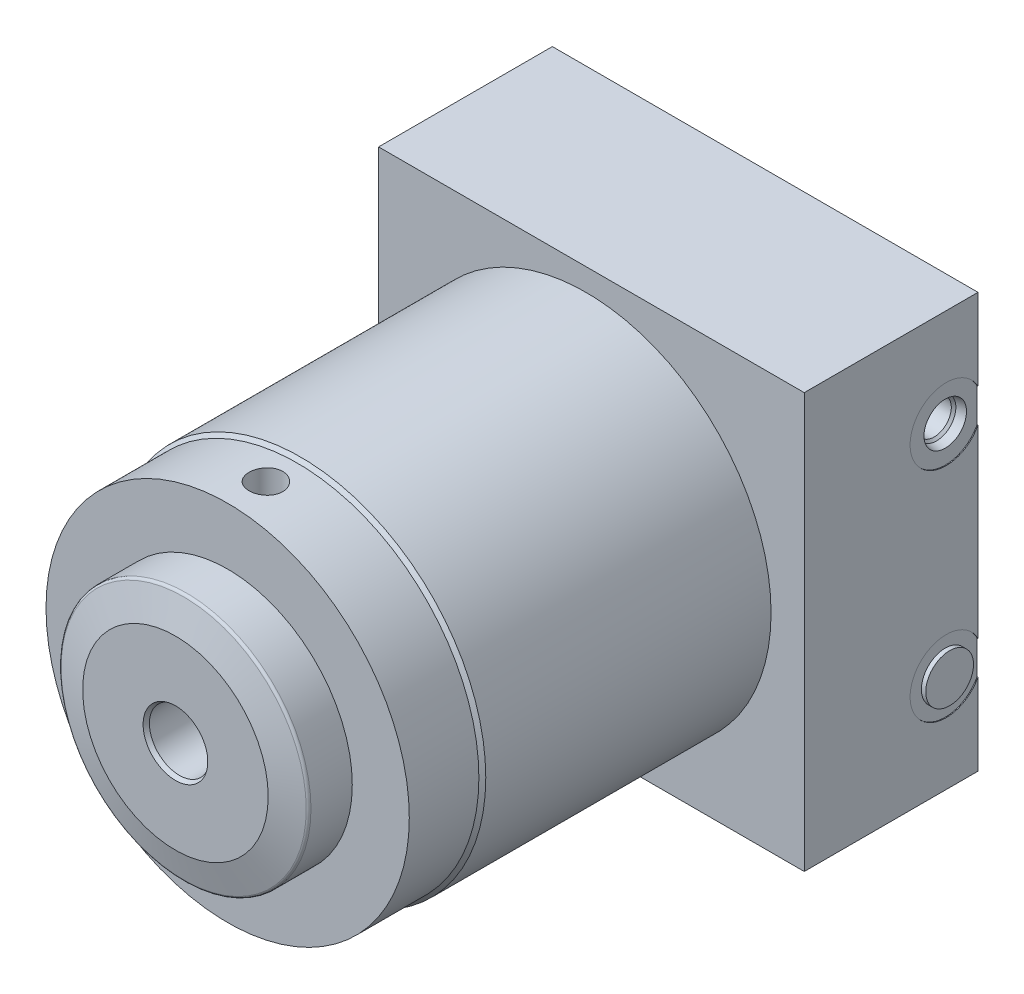
ISO-10303-21;
HEADER;
FILE_DESCRIPTION(('STEP AP214'),'2;1');
FILE_NAME('part.step','',(''),(''),'','','');
FILE_SCHEMA(('AUTOMOTIVE_DESIGN { 1 0 10303 214 1 1 1 1 }'));
ENDSEC;
DATA;
#1=APPLICATION_CONTEXT('core data for automotive mechanical design processes');
#2=APPLICATION_PROTOCOL_DEFINITION('international standard','automotive_design',2000,#1);
#3=PRODUCT_CONTEXT('',#1,'mechanical');
#4=PRODUCT('Part','Part','',(#3));
#5=PRODUCT_RELATED_PRODUCT_CATEGORY('part','',(#4));
#6=PRODUCT_DEFINITION_FORMATION('','',#4);
#7=PRODUCT_DEFINITION_CONTEXT('part definition',#1,'design');
#8=PRODUCT_DEFINITION('design','',#6,#7);
#9=PRODUCT_DEFINITION_SHAPE('','',#8);
#10=(LENGTH_UNIT() NAMED_UNIT(*) SI_UNIT(.MILLI.,.METRE.));
#11=(NAMED_UNIT(*) PLANE_ANGLE_UNIT() SI_UNIT($,.RADIAN.));
#12=(NAMED_UNIT(*) SI_UNIT($,.STERADIAN.) SOLID_ANGLE_UNIT());
#13=UNCERTAINTY_MEASURE_WITH_UNIT(LENGTH_MEASURE(1.E-05),#10,'distance_accuracy_value','');
#14=(GEOMETRIC_REPRESENTATION_CONTEXT(3) GLOBAL_UNCERTAINTY_ASSIGNED_CONTEXT((#13)) GLOBAL_UNIT_ASSIGNED_CONTEXT((#10,
#11,#12)) REPRESENTATION_CONTEXT('',''));
#15=CARTESIAN_POINT('',(0.,0.,0.));
#16=DIRECTION('',(0.,0.,1.));
#17=DIRECTION('',(1.,0.,0.));
#18=AXIS2_PLACEMENT_3D('',#15,#16,#17);
#19=CARTESIAN_POINT('',(63.246,-31.75,-17.7292));
#20=DIRECTION('',(1.,0.,0.));
#21=DIRECTION('',(0.,0.,-1.));
#22=AXIS2_PLACEMENT_3D('',#19,#20,#21);
#23=PLANE('',#22);
#24=DIRECTION('',(0.,1.,0.));
#25=VECTOR('',#24,1.);
#26=CARTESIAN_POINT('',(63.246,60.325,-27.0002));
#27=LINE('',#26,#25);
#28=CARTESIAN_POINT('',(63.246,-36.6312462804083,-27.0002));
#29=VERTEX_POINT('',#28);
#30=CARTESIAN_POINT('',(63.246,-26.8687537195917,-27.0002));
#31=VERTEX_POINT('',#30);
#32=EDGE_CURVE('E202',#29,#31,#27,.T.);
#33=ORIENTED_EDGE('',*,*,#32,.T.);
#34=CARTESIAN_POINT('',(63.246,-31.75,-17.7292));
#35=DIRECTION('',(1.,0.,0.));
#36=DIRECTION('',(0.,0.,-1.));
#37=AXIS2_PLACEMENT_3D('',#34,#35,#36);
#38=CIRCLE('',#37,10.4775);
#39=EDGE_CURVE('E57',#31,#29,#38,.T.);
#40=ORIENTED_EDGE('',*,*,#39,.T.);
#41=EDGE_LOOP('',(#33,#40));
#42=FACE_BOUND('',#41,.T.);
#43=CARTESIAN_POINT('',(63.246,-31.75,-17.7292));
#44=DIRECTION('',(1.,0.,0.));
#45=DIRECTION('',(0.,0.,-1.));
#46=AXIS2_PLACEMENT_3D('',#43,#44,#45);
#47=CIRCLE('',#46,6.9469);
#48=CARTESIAN_POINT('',(63.246,-31.75,-24.6761));
#49=VERTEX_POINT('',#48);
#50=EDGE_CURVE('E117',#49,#49,#47,.T.);
#51=ORIENTED_EDGE('',*,*,#50,.F.);
#52=EDGE_LOOP('',(#51));
#53=FACE_BOUND('',#52,.T.);
#54=ADVANCED_FACE('F32',(#42,#53),#23,.T.);
#55=CARTESIAN_POINT('',(0.,0.,127.7874));
#56=DIRECTION('',(0.,0.,-1.));
#57=DIRECTION('',(-1.,0.,0.));
#58=AXIS2_PLACEMENT_3D('',#55,#56,#57);
#59=CYLINDRICAL_SURFACE('',#58,53.848);
#60=CARTESIAN_POINT('',(0.,0.,106.5403));
#61=DIRECTION('',(0.,0.,1.));
#62=DIRECTION('',(1.,0.,0.));
#63=AXIS2_PLACEMENT_3D('',#60,#61,#62);
#64=CIRCLE('',#63,53.848);
#65=CARTESIAN_POINT('',(53.848,0.,106.5403));
#66=VERTEX_POINT('',#65);
#67=EDGE_CURVE('E190',#66,#66,#64,.T.);
#68=ORIENTED_EDGE('',*,*,#67,.F.);
#69=EDGE_LOOP('',(#68));
#70=FACE_BOUND('',#69,.T.);
#71=CARTESIAN_POINT('',(0.,0.,23.5458));
#72=DIRECTION('',(0.,0.,-1.));
#73=DIRECTION('',(-1.,0.,0.));
#74=AXIS2_PLACEMENT_3D('',#71,#72,#73);
#75=CIRCLE('',#74,53.848);
#76=CARTESIAN_POINT('',(-53.848,0.,23.5458));
#77=VERTEX_POINT('',#76);
#78=EDGE_CURVE('E199',#77,#77,#75,.T.);
#79=ORIENTED_EDGE('',*,*,#78,.F.);
#80=EDGE_LOOP('',(#79));
#81=FACE_BOUND('',#80,.T.);
#82=ADVANCED_FACE('F273',(#70,#81),#59,.T.);
#83=CARTESIAN_POINT('',(0.,0.,127.7874));
#84=DIRECTION('',(0.,0.,1.));
#85=DIRECTION('',(1.,0.,0.));
#86=AXIS2_PLACEMENT_3D('',#83,#84,#85);
#87=PLANE('',#86);
#88=CARTESIAN_POINT('',(0.,0.,127.7874));
#89=DIRECTION('',(0.,0.,1.));
#90=DIRECTION('',(1.,0.,0.));
#91=AXIS2_PLACEMENT_3D('',#88,#89,#90);
#92=CIRCLE('',#91,52.8447);
#93=CARTESIAN_POINT('',(52.8447,0.,127.7874));
#94=VERTEX_POINT('',#93);
#95=EDGE_CURVE('E196',#94,#94,#92,.T.);
#96=ORIENTED_EDGE('',*,*,#95,.T.);
#97=EDGE_LOOP('',(#96));
#98=FACE_BOUND('',#97,.T.);
#99=CARTESIAN_POINT('',(0.,0.,127.7874));
#100=DIRECTION('',(0.,0.,1.));
#101=DIRECTION('',(1.,0.,0.));
#102=AXIS2_PLACEMENT_3D('',#99,#100,#101);
#103=CIRCLE('',#102,36.2585);
#104=CARTESIAN_POINT('',(36.2585,0.,127.7874));
#105=VERTEX_POINT('',#104);
#106=EDGE_CURVE('E187',#105,#105,#103,.T.);
#107=ORIENTED_EDGE('',*,*,#106,.F.);
#108=EDGE_LOOP('',(#107));
#109=FACE_BOUND('',#108,.T.);
#110=ADVANCED_FACE('F330',(#98,#109),#87,.T.);
#111=CARTESIAN_POINT('',(0.,0.,160.082178916781));
#112=DIRECTION('',(0.,0.,1.));
#113=DIRECTION('',(1.,0.,0.));
#114=AXIS2_PLACEMENT_3D('',#111,#112,#113);
#115=CYLINDRICAL_SURFACE('',#114,52.8447);
#116=CARTESIAN_POINT('',(0.,-52.8447,121.5517));
#117=CARTESIAN_POINT('',(-0.13705700282078,-52.8447003261192,121.551701292624));
#118=CARTESIAN_POINT('',(-0.27409407378406,-52.8441657135478,121.545935053901));
#119=CARTESIAN_POINT('',(-0.547235526896936,-52.8420428949678,121.522912528455));
#120=CARTESIAN_POINT('',(-0.683339674091867,-52.8404544327365,121.50565344747));
#121=CARTESIAN_POINT('',(-0.953708841805919,-52.8362664879881,121.459748221065));
#122=CARTESIAN_POINT('',(-1.08797227975399,-52.8336661858339,121.431092843703));
#123=CARTESIAN_POINT('',(-1.35364451982924,-52.8275271623704,121.362591627997));
#124=CARTESIAN_POINT('',(-1.48505225848269,-52.8239880977287,121.322741695169));
#125=CARTESIAN_POINT('',(-1.74390520915612,-52.8160758271064,121.232187796075));
#126=CARTESIAN_POINT('',(-1.87135409430821,-52.8117034229448,121.181494257574));
#127=CARTESIAN_POINT('',(-2.12156866939713,-52.8022437628651,121.069574147021));
#128=CARTESIAN_POINT('',(-2.2443326146653,-52.7971562438788,121.008343696904));
#129=CARTESIAN_POINT('',(-2.48419501673236,-52.7864139685561,120.875838277263));
#130=CARTESIAN_POINT('',(-2.60129671199148,-52.7807595422828,120.804569142756));
#131=CARTESIAN_POINT('',(-2.82913313363359,-52.7690377292235,120.652436386492));
#132=CARTESIAN_POINT('',(-2.93986548643539,-52.762970190304,120.571569221913));
#133=CARTESIAN_POINT('',(-3.15439830030838,-52.7505797515681,120.40062719304));
#134=CARTESIAN_POINT('',(-3.25818156261035,-52.7442562761268,120.310530785407));
#135=CARTESIAN_POINT('',(-3.45783341988848,-52.7315438636178,120.121891707345));
#136=CARTESIAN_POINT('',(-3.55369907556744,-52.7251549032202,120.023345927633));
#137=CARTESIAN_POINT('',(-3.73676849480103,-52.7124966025206,119.818563075617));
#138=CARTESIAN_POINT('',(-3.82397504753015,-52.7062272242292,119.71232849913));
#139=CARTESIAN_POINT('',(-3.98917633214333,-52.6939812095426,119.492845813926));
#140=CARTESIAN_POINT('',(-4.06716765269796,-52.6880046820323,119.379595131461));
#141=CARTESIAN_POINT('',(-4.2134530712586,-52.676508285125,119.146743109424));
#142=CARTESIAN_POINT('',(-4.28173300495795,-52.6709890875514,119.027132836316));
#143=CARTESIAN_POINT('',(-4.40799573299597,-52.6605725966058,118.782515815191));
#144=CARTESIAN_POINT('',(-4.46597470565961,-52.6556755342382,118.657507085629));
#145=CARTESIAN_POINT('',(-4.57116592163192,-52.6466480950573,118.403058099893));
#146=CARTESIAN_POINT('',(-4.61838231764562,-52.6425174226498,118.273619575189));
#147=CARTESIAN_POINT('',(-4.70174797643925,-52.6351366338674,118.011187884259));
#148=CARTESIAN_POINT('',(-4.73789316182492,-52.6318868419609,117.878193427985));
#149=CARTESIAN_POINT('',(-4.82906268411877,-52.6236297247141,117.476162956106));
#150=CARTESIAN_POINT('',(-4.86724159143658,-52.6200773175563,117.203059348283));
#151=CARTESIAN_POINT('',(-4.89721629716278,-52.6172954862447,116.654447711109));
#152=CARTESIAN_POINT('',(-4.88901315032654,-52.6180659637859,116.378939736578));
#153=CARTESIAN_POINT('',(-4.82662513005306,-52.6238251502279,115.834058082182));
#154=CARTESIAN_POINT('',(-4.77258279640305,-52.6288007827662,115.564668041559));
#155=CARTESIAN_POINT('',(-4.62025593503476,-52.6423911599283,115.038809033096));
#156=CARTESIAN_POINT('',(-4.52197088733053,-52.651005947323,114.782340217158));
#157=CARTESIAN_POINT('',(-4.2837944277814,-52.6709185004957,114.289138624571));
#158=CARTESIAN_POINT('',(-4.14383942500829,-52.6822203615649,114.052436725546));
#159=CARTESIAN_POINT('',(-3.82634046865282,-52.7062301673473,113.605829366491));
#160=CARTESIAN_POINT('',(-3.64879557428614,-52.7189381472485,113.395924577338));
#161=CARTESIAN_POINT('',(-3.26035907581587,-52.7443865407074,113.008040171498));
#162=CARTESIAN_POINT('',(-3.04934427708855,-52.7571268959207,112.830183897068));
#163=CARTESIAN_POINT('',(-2.60038654801204,-52.7811591144091,112.512400356881));
#164=CARTESIAN_POINT('',(-2.36244359366438,-52.7924509763931,112.372473124927));
#165=CARTESIAN_POINT('',(-1.86630093131392,-52.8123168709128,112.134525855316));
#166=CARTESIAN_POINT('',(-1.60809838533135,-52.8208905218285,112.036511701323));
#167=CARTESIAN_POINT('',(-1.07880460132766,-52.8343498816292,111.885261360395));
#168=CARTESIAN_POINT('',(-0.807713693341591,-52.8392356848958,111.832024027503));
#169=CARTESIAN_POINT('',(-0.261407067711391,-52.8447567372573,111.771994147906));
#170=CARTESIAN_POINT('',(0.0137897880380407,-52.8454075700579,111.765031319771));
#171=CARTESIAN_POINT('',(0.561435085721646,-52.842427059595,111.797301412246));
#172=CARTESIAN_POINT('',(0.833883559325274,-52.8387957657311,111.836533799937));
#173=CARTESIAN_POINT('',(1.36780960386314,-52.8276692060877,111.959939435147));
#174=CARTESIAN_POINT('',(1.62930566964462,-52.8201807637625,112.044033330163));
#175=CARTESIAN_POINT('',(2.13447793422536,-52.802180530434,112.254693621062));
#176=CARTESIAN_POINT('',(2.3781537883167,-52.7916686809665,112.38126083827));
#177=CARTESIAN_POINT('',(2.84154086022017,-52.7687597997701,112.673699676334));
#178=CARTESIAN_POINT('',(3.06118092791831,-52.7563574179359,112.839683612572));
#179=CARTESIAN_POINT('',(3.46954227601198,-52.731077506044,113.206083587671));
#180=CARTESIAN_POINT('',(3.65826289325939,-52.7181999658026,113.406500364844));
#181=CARTESIAN_POINT('',(4.00001651273476,-52.6933744921516,113.836814348216));
#182=CARTESIAN_POINT('',(4.15293805800524,-52.6814295372159,114.066800260359));
#183=CARTESIAN_POINT('',(4.41798597452665,-52.6598659440582,114.549298323095));
#184=CARTESIAN_POINT('',(4.53011283352248,-52.6502472780234,114.801810204321));
#185=CARTESIAN_POINT('',(4.71020561717052,-52.6344419563786,115.321753035862));
#186=CARTESIAN_POINT('',(4.77823875147994,-52.6282500796157,115.589160602591));
#187=CARTESIAN_POINT('',(4.86841178718951,-52.6199869881758,116.131813567986));
#188=CARTESIAN_POINT('',(4.89055279915964,-52.6179156737831,116.407058776821));
#189=CARTESIAN_POINT('',(4.8889153933128,-52.6180644490635,116.818987437209));
#190=CARTESIAN_POINT('',(4.88259347520532,-52.6186536740755,116.955955572445));
#191=CARTESIAN_POINT('',(4.85848103212153,-52.6208861376417,117.228856228747));
#192=CARTESIAN_POINT('',(4.84069476066245,-52.6225289852785,117.364789114993));
#193=CARTESIAN_POINT('',(4.79376925771384,-52.6268243407372,117.63470613269));
#194=CARTESIAN_POINT('',(4.76462585765121,-52.6294772192772,117.768689529837));
#195=CARTESIAN_POINT('',(4.69521325351769,-52.6357151111062,118.033670315625));
#196=CARTESIAN_POINT('',(4.65494812367394,-52.6392997830228,118.164668778751));
#197=CARTESIAN_POINT('',(4.56356524546467,-52.6473009011187,118.422835918452));
#198=CARTESIAN_POINT('',(4.51244462955513,-52.6517175670395,118.55000357294));
#199=CARTESIAN_POINT('',(4.39974458801886,-52.6612548329167,118.79953299031));
#200=CARTESIAN_POINT('',(4.33816899015739,-52.6663751751137,118.921896491968));
#201=CARTESIAN_POINT('',(4.20496073716075,-52.677178054019,119.161051129375));
#202=CARTESIAN_POINT('',(4.133324561191,-52.6828607873371,119.277840295056));
#203=CARTESIAN_POINT('',(3.98054622279723,-52.6946243471303,119.504942423582));
#204=CARTESIAN_POINT('',(3.89940752497808,-52.7007050281597,119.615257724903));
#205=CARTESIAN_POINT('',(3.72783129316156,-52.713119968691,119.829115257724));
#206=CARTESIAN_POINT('',(3.63735794080093,-52.7194551433495,119.932628701594));
#207=CARTESIAN_POINT('',(3.44805563837857,-52.7321744636716,120.131634458323));
#208=CARTESIAN_POINT('',(3.34922975446691,-52.7385585905896,120.227129689165));
#209=CARTESIAN_POINT('',(3.14382563304375,-52.7512015954118,120.409525280512));
#210=CARTESIAN_POINT('',(3.03724270688454,-52.7574603946,120.496420366626));
#211=CARTESIAN_POINT('',(2.81716805971761,-52.7696695149176,120.660904730576));
#212=CARTESIAN_POINT('',(2.70367890381534,-52.7756199490775,120.738497432075));
#213=CARTESIAN_POINT('',(2.47025271206718,-52.7870614495552,120.884051322779));
#214=CARTESIAN_POINT('',(2.35029978922995,-52.7925512905193,120.951987134403));
#215=CARTESIAN_POINT('',(2.1051113938884,-52.8028964501513,121.077477609259));
#216=CARTESIAN_POINT('',(1.97987787568283,-52.8077520008844,121.135036072159));
#217=CARTESIAN_POINT('',(1.72507935497155,-52.816689130906,121.239343648041));
#218=CARTESIAN_POINT('',(1.59551804549026,-52.8207713512062,121.286101720552));
#219=CARTESIAN_POINT('',(1.3329337033625,-52.8280499517845,121.368518606586));
#220=CARTESIAN_POINT('',(1.19991153845807,-52.8312465518172,121.404180173826));
#221=CARTESIAN_POINT('',(0.890904404889697,-52.8374781097648,121.473179222729));
#222=CARTESIAN_POINT('',(0.714023172887017,-52.8401757208131,121.502596703747));
#223=CARTESIAN_POINT('',(0.358083286573468,-52.8437864499009,121.541856214812));
#224=CARTESIAN_POINT('',(0.179024639684624,-52.8446995740212,121.551698311567));
#225=CARTESIAN_POINT('',(0.,-52.8447,121.5517));
#226=B_SPLINE_CURVE_WITH_KNOTS('',3,(#116,#117,#118,#119,#120,#121,#122,#123,#124,#125,#126,
#127,#128,#129,#130,#131,#132,#133,#134,#135,#136,#137,#138,#139,#140,#141,#142,#143,#144,#145,
#146,#147,#148,#149,#150,#151,#152,#153,#154,#155,#156,#157,#158,#159,#160,#161,#162,#163,#164,
#165,#166,#167,#168,#169,#170,#171,#172,#173,#174,#175,#176,#177,#178,#179,#180,#181,#182,#183,
#184,#185,#186,#187,#188,#189,#190,#191,#192,#193,#194,#195,#196,#197,#198,#199,#200,#201,#202,
#203,#204,#205,#206,#207,#208,#209,#210,#211,#212,#213,#214,#215,#216,#217,#218,#219,#220,#221,
#222,#223,#224,#225),.UNSPECIFIED.,.T.,.F.,(4,2,2,2,2,2,2,2,2,2,2,2,2,2,2,2,2,2,2,2,2,2,2,2,2,2,
2,2,2,2,2,2,2,2,2,2,2,2,2,2,2,2,2,2,2,2,2,2,2,2,2,2,2,2,4),(0.,0.411014481642333,
0.822128930033263,1.23357709574276,1.6451759478492,2.05638075081158,2.46773722086711,
2.87885556781401,3.29012614139795,3.7023795983892,4.11478541698117,4.52705796208171,
4.93948264879175,5.35250283081183,5.76567592553228,6.1786893278819,6.5918546557342,
7.41491417840075,8.23795498428198,9.05844583689334,9.87894633301023,10.7007054380665,
11.5224851122026,12.347362920251,13.1722414634392,13.9972357632719,14.8222089486652,
15.6441446997098,16.4660709687909,17.2865481850007,18.1070412680379,18.9299009551815,
19.7527782883837,20.5781844747211,21.4035807921044,22.2277160255715,23.0518313150808,
23.4627771930409,23.8735706890966,24.2845151069306,24.6953091825554,25.1062119072736,
25.5169645159038,25.9278612328096,26.3386086010808,26.7509952189796,27.1632311050277,
27.5757182651083,27.9880531437718,28.4014523310768,28.8146998434714,29.2276033027462,
29.6404042136933,30.17727550601,30.7141449688378),.UNSPECIFIED.);
#227=CARTESIAN_POINT('',(0.,-52.8447,121.5517));
#228=VERTEX_POINT('',#227);
#229=EDGE_CURVE('E11',#228,#228,#226,.T.);
#230=ORIENTED_EDGE('',*,*,#229,.F.);
#231=EDGE_LOOP('',(#230));
#232=FACE_BOUND('',#231,.T.);
#233=CARTESIAN_POINT('',(0.,52.8447,121.5517));
#234=CARTESIAN_POINT('',(0.13705700282078,52.8447003261192,121.551701292624));
#235=CARTESIAN_POINT('',(0.27409407378406,52.8441657135478,121.545935053901));
#236=CARTESIAN_POINT('',(0.547235526896936,52.8420428949678,121.522912528455));
#237=CARTESIAN_POINT('',(0.683339674091867,52.8404544327365,121.50565344747));
#238=CARTESIAN_POINT('',(0.953708841805919,52.8362664879881,121.459748221065));
#239=CARTESIAN_POINT('',(1.08797227975399,52.8336661858339,121.431092843703));
#240=CARTESIAN_POINT('',(1.35364451982924,52.8275271623704,121.362591627997));
#241=CARTESIAN_POINT('',(1.48505225848269,52.8239880977287,121.322741695169));
#242=CARTESIAN_POINT('',(1.74390520915612,52.8160758271064,121.232187796075));
#243=CARTESIAN_POINT('',(1.87135409430821,52.8117034229448,121.181494257574));
#244=CARTESIAN_POINT('',(2.12156866939713,52.8022437628651,121.069574147021));
#245=CARTESIAN_POINT('',(2.2443326146653,52.7971562438788,121.008343696904));
#246=CARTESIAN_POINT('',(2.48419501673236,52.7864139685561,120.875838277263));
#247=CARTESIAN_POINT('',(2.60129671199148,52.7807595422828,120.804569142756));
#248=CARTESIAN_POINT('',(2.82913313363359,52.7690377292235,120.652436386492));
#249=CARTESIAN_POINT('',(2.93986548643539,52.762970190304,120.571569221913));
#250=CARTESIAN_POINT('',(3.15439830030838,52.7505797515681,120.40062719304));
#251=CARTESIAN_POINT('',(3.25818156261035,52.7442562761268,120.310530785407));
#252=CARTESIAN_POINT('',(3.45783341988848,52.7315438636178,120.121891707345));
#253=CARTESIAN_POINT('',(3.55369907556744,52.7251549032202,120.023345927633));
#254=CARTESIAN_POINT('',(3.73676849480103,52.7124966025206,119.818563075617));
#255=CARTESIAN_POINT('',(3.82397504753015,52.7062272242292,119.71232849913));
#256=CARTESIAN_POINT('',(3.98917633214333,52.6939812095426,119.492845813926));
#257=CARTESIAN_POINT('',(4.06716765269796,52.6880046820323,119.379595131461));
#258=CARTESIAN_POINT('',(4.2134530712586,52.676508285125,119.146743109424));
#259=CARTESIAN_POINT('',(4.28173300495795,52.6709890875514,119.027132836316));
#260=CARTESIAN_POINT('',(4.40799573299597,52.6605725966058,118.782515815191));
#261=CARTESIAN_POINT('',(4.46597470565961,52.6556755342382,118.657507085629));
#262=CARTESIAN_POINT('',(4.57116592163192,52.6466480950573,118.403058099893));
#263=CARTESIAN_POINT('',(4.61838231764562,52.6425174226498,118.273619575189));
#264=CARTESIAN_POINT('',(4.70174797643925,52.6351366338674,118.011187884259));
#265=CARTESIAN_POINT('',(4.73789316182492,52.6318868419609,117.878193427985));
#266=CARTESIAN_POINT('',(4.82906268411877,52.6236297247141,117.476162956106));
#267=CARTESIAN_POINT('',(4.86724159143658,52.6200773175563,117.203059348283));
#268=CARTESIAN_POINT('',(4.89721629716278,52.6172954862447,116.654447711109));
#269=CARTESIAN_POINT('',(4.88901315032654,52.6180659637859,116.378939736578));
#270=CARTESIAN_POINT('',(4.82662513005306,52.6238251502279,115.834058082182));
#271=CARTESIAN_POINT('',(4.77258279640305,52.6288007827662,115.564668041559));
#272=CARTESIAN_POINT('',(4.62025593503476,52.6423911599283,115.038809033096));
#273=CARTESIAN_POINT('',(4.52197088733053,52.651005947323,114.782340217158));
#274=CARTESIAN_POINT('',(4.2837944277814,52.6709185004957,114.289138624571));
#275=CARTESIAN_POINT('',(4.14383942500829,52.6822203615649,114.052436725546));
#276=CARTESIAN_POINT('',(3.82634046865282,52.7062301673473,113.605829366491));
#277=CARTESIAN_POINT('',(3.64879557428614,52.7189381472485,113.395924577338));
#278=CARTESIAN_POINT('',(3.26035907581587,52.7443865407074,113.008040171498));
#279=CARTESIAN_POINT('',(3.04934427708855,52.7571268959207,112.830183897068));
#280=CARTESIAN_POINT('',(2.60038654801204,52.7811591144091,112.512400356881));
#281=CARTESIAN_POINT('',(2.36244359366438,52.7924509763931,112.372473124927));
#282=CARTESIAN_POINT('',(1.86630093131392,52.8123168709128,112.134525855316));
#283=CARTESIAN_POINT('',(1.60809838533135,52.8208905218285,112.036511701323));
#284=CARTESIAN_POINT('',(1.07880460132766,52.8343498816292,111.885261360395));
#285=CARTESIAN_POINT('',(0.807713693341591,52.8392356848958,111.832024027503));
#286=CARTESIAN_POINT('',(0.261407067711391,52.8447567372573,111.771994147906));
#287=CARTESIAN_POINT('',(-0.0137897880380407,52.8454075700579,111.765031319771));
#288=CARTESIAN_POINT('',(-0.561435085721646,52.842427059595,111.797301412246));
#289=CARTESIAN_POINT('',(-0.833883559325274,52.8387957657311,111.836533799937));
#290=CARTESIAN_POINT('',(-1.36780960386314,52.8276692060877,111.959939435147));
#291=CARTESIAN_POINT('',(-1.62930566964462,52.8201807637625,112.044033330163));
#292=CARTESIAN_POINT('',(-2.13447793422536,52.802180530434,112.254693621062));
#293=CARTESIAN_POINT('',(-2.3781537883167,52.7916686809665,112.38126083827));
#294=CARTESIAN_POINT('',(-2.84154086022017,52.7687597997701,112.673699676334));
#295=CARTESIAN_POINT('',(-3.06118092791831,52.7563574179359,112.839683612572));
#296=CARTESIAN_POINT('',(-3.46954227601198,52.731077506044,113.206083587671));
#297=CARTESIAN_POINT('',(-3.65826289325939,52.7181999658026,113.406500364844));
#298=CARTESIAN_POINT('',(-4.00001651273476,52.6933744921516,113.836814348216));
#299=CARTESIAN_POINT('',(-4.15293805800524,52.6814295372159,114.066800260359));
#300=CARTESIAN_POINT('',(-4.41798597452665,52.6598659440582,114.549298323095));
#301=CARTESIAN_POINT('',(-4.53011283352248,52.6502472780234,114.801810204321));
#302=CARTESIAN_POINT('',(-4.71020561717052,52.6344419563786,115.321753035862));
#303=CARTESIAN_POINT('',(-4.77823875147994,52.6282500796157,115.589160602591));
#304=CARTESIAN_POINT('',(-4.86841178718951,52.6199869881758,116.131813567986));
#305=CARTESIAN_POINT('',(-4.89055279915964,52.6179156737831,116.407058776821));
#306=CARTESIAN_POINT('',(-4.8889153933128,52.6180644490635,116.818987437209));
#307=CARTESIAN_POINT('',(-4.88259347520532,52.6186536740755,116.955955572445));
#308=CARTESIAN_POINT('',(-4.85848103212153,52.6208861376417,117.228856228747));
#309=CARTESIAN_POINT('',(-4.84069476066245,52.6225289852785,117.364789114993));
#310=CARTESIAN_POINT('',(-4.79376925771384,52.6268243407372,117.63470613269));
#311=CARTESIAN_POINT('',(-4.76462585765121,52.6294772192772,117.768689529837));
#312=CARTESIAN_POINT('',(-4.69521325351769,52.6357151111062,118.033670315625));
#313=CARTESIAN_POINT('',(-4.65494812367394,52.6392997830228,118.164668778751));
#314=CARTESIAN_POINT('',(-4.56356524546467,52.6473009011187,118.422835918452));
#315=CARTESIAN_POINT('',(-4.51244462955513,52.6517175670395,118.55000357294));
#316=CARTESIAN_POINT('',(-4.39974458801886,52.6612548329167,118.79953299031));
#317=CARTESIAN_POINT('',(-4.33816899015739,52.6663751751137,118.921896491968));
#318=CARTESIAN_POINT('',(-4.20496073716075,52.677178054019,119.161051129375));
#319=CARTESIAN_POINT('',(-4.133324561191,52.6828607873371,119.277840295056));
#320=CARTESIAN_POINT('',(-3.98054622279723,52.6946243471303,119.504942423582));
#321=CARTESIAN_POINT('',(-3.89940752497808,52.7007050281597,119.615257724903));
#322=CARTESIAN_POINT('',(-3.72783129316156,52.713119968691,119.829115257724));
#323=CARTESIAN_POINT('',(-3.63735794080093,52.7194551433495,119.932628701594));
#324=CARTESIAN_POINT('',(-3.44805563837857,52.7321744636716,120.131634458323));
#325=CARTESIAN_POINT('',(-3.34922975446691,52.7385585905896,120.227129689165));
#326=CARTESIAN_POINT('',(-3.14382563304375,52.7512015954118,120.409525280512));
#327=CARTESIAN_POINT('',(-3.03724270688454,52.7574603946,120.496420366626));
#328=CARTESIAN_POINT('',(-2.81716805971761,52.7696695149176,120.660904730576));
#329=CARTESIAN_POINT('',(-2.70367890381534,52.7756199490775,120.738497432075));
#330=CARTESIAN_POINT('',(-2.47025271206718,52.7870614495552,120.884051322779));
#331=CARTESIAN_POINT('',(-2.35029978922995,52.7925512905193,120.951987134403));
#332=CARTESIAN_POINT('',(-2.1051113938884,52.8028964501513,121.077477609259));
#333=CARTESIAN_POINT('',(-1.97987787568283,52.8077520008844,121.135036072159));
#334=CARTESIAN_POINT('',(-1.72507935497155,52.816689130906,121.239343648041));
#335=CARTESIAN_POINT('',(-1.59551804549026,52.8207713512062,121.286101720552));
#336=CARTESIAN_POINT('',(-1.3329337033625,52.8280499517845,121.368518606586));
#337=CARTESIAN_POINT('',(-1.19991153845807,52.8312465518172,121.404180173826));
#338=CARTESIAN_POINT('',(-0.890904404889697,52.8374781097648,121.473179222729));
#339=CARTESIAN_POINT('',(-0.714023172887017,52.8401757208131,121.502596703747));
#340=CARTESIAN_POINT('',(-0.358083286573468,52.8437864499009,121.541856214812));
#341=CARTESIAN_POINT('',(-0.179024639684624,52.8446995740212,121.551698311567));
#342=CARTESIAN_POINT('',(0.,52.8447,121.5517));
#343=B_SPLINE_CURVE_WITH_KNOTS('',3,(#233,#234,#235,#236,#237,#238,#239,#240,#241,#242,#243,
#244,#245,#246,#247,#248,#249,#250,#251,#252,#253,#254,#255,#256,#257,#258,#259,#260,#261,#262,
#263,#264,#265,#266,#267,#268,#269,#270,#271,#272,#273,#274,#275,#276,#277,#278,#279,#280,#281,
#282,#283,#284,#285,#286,#287,#288,#289,#290,#291,#292,#293,#294,#295,#296,#297,#298,#299,#300,
#301,#302,#303,#304,#305,#306,#307,#308,#309,#310,#311,#312,#313,#314,#315,#316,#317,#318,#319,
#320,#321,#322,#323,#324,#325,#326,#327,#328,#329,#330,#331,#332,#333,#334,#335,#336,#337,#338,
#339,#340,#341,#342),.UNSPECIFIED.,.T.,.F.,(4,2,2,2,2,2,2,2,2,2,2,2,2,2,2,2,2,2,2,2,2,2,2,2,2,2,
2,2,2,2,2,2,2,2,2,2,2,2,2,2,2,2,2,2,2,2,2,2,2,2,2,2,2,2,4),(0.,0.411014481642333,
0.822128930033263,1.23357709574276,1.6451759478492,2.05638075081158,2.46773722086711,
2.87885556781401,3.29012614139795,3.7023795983892,4.11478541698117,4.52705796208171,
4.93948264879175,5.35250283081183,5.76567592553228,6.1786893278819,6.5918546557342,
7.41491417840075,8.23795498428198,9.05844583689334,9.87894633301023,10.7007054380665,
11.5224851122026,12.347362920251,13.1722414634392,13.9972357632719,14.8222089486652,
15.6441446997098,16.4660709687909,17.2865481850007,18.1070412680379,18.9299009551815,
19.7527782883837,20.5781844747211,21.4035807921044,22.2277160255715,23.0518313150808,
23.4627771930409,23.8735706890966,24.2845151069306,24.6953091825554,25.1062119072736,
25.5169645159038,25.9278612328096,26.3386086010808,26.7509952189796,27.1632311050277,
27.5757182651083,27.9880531437718,28.4014523310768,28.8146998434714,29.2276033027462,
29.6404042136933,30.17727550601,30.7141449688378),.UNSPECIFIED.);
#344=CARTESIAN_POINT('',(0.,52.8447,121.5517));
#345=VERTEX_POINT('',#344);
#346=EDGE_CURVE('E44',#345,#345,#343,.T.);
#347=ORIENTED_EDGE('',*,*,#346,.F.);
#348=EDGE_LOOP('',(#347));
#349=FACE_BOUND('',#348,.T.);
#350=CARTESIAN_POINT('',(0.,0.,107.5436));
#351=DIRECTION('',(0.,0.,1.));
#352=DIRECTION('',(1.,0.,0.));
#353=AXIS2_PLACEMENT_3D('',#350,#351,#352);
#354=CIRCLE('',#353,52.8447);
#355=CARTESIAN_POINT('',(52.8447,0.,107.5436));
#356=VERTEX_POINT('',#355);
#357=EDGE_CURVE('E193',#356,#356,#354,.T.);
#358=ORIENTED_EDGE('',*,*,#357,.T.);
#359=EDGE_LOOP('',(#358));
#360=FACE_BOUND('',#359,.T.);
#361=ORIENTED_EDGE('',*,*,#95,.F.);
#362=EDGE_LOOP('',(#361));
#363=FACE_BOUND('',#362,.T.);
#364=ADVANCED_FACE('F227',(#232,#349,#360,#363),#115,.T.);
#365=CARTESIAN_POINT('',(0.,0.,107.5436));
#366=DIRECTION('',(0.,0.,-1.));
#367=DIRECTION('',(-1.,0.,0.));
#368=AXIS2_PLACEMENT_3D('',#365,#366,#367);
#369=CONICAL_SURFACE('',#368,52.8447,0.785398163397455);
#370=ORIENTED_EDGE('',*,*,#67,.T.);
#371=EDGE_LOOP('',(#370));
#372=FACE_BOUND('',#371,.T.);
#373=ORIENTED_EDGE('',*,*,#357,.F.);
#374=EDGE_LOOP('',(#373));
#375=FACE_BOUND('',#374,.T.);
#376=ADVANCED_FACE('F323',(#372,#375),#369,.T.);
#377=CARTESIAN_POINT('',(0.,0.,113.59896));
#378=DIRECTION('',(0.,0.,1.));
#379=DIRECTION('',(1.,0.,0.));
#380=AXIS2_PLACEMENT_3D('',#377,#378,#379);
#381=CYLINDRICAL_SURFACE('',#380,36.2585);
#382=CARTESIAN_POINT('',(0.,0.,139.8016));
#383=DIRECTION('',(0.,0.,1.));
#384=DIRECTION('',(1.,0.,0.));
#385=AXIS2_PLACEMENT_3D('',#382,#383,#384);
#386=CIRCLE('',#385,36.2585);
#387=CARTESIAN_POINT('',(36.2585,0.,139.8016));
#388=VERTEX_POINT('',#387);
#389=EDGE_CURVE('E174',#388,#388,#386,.T.);
#390=ORIENTED_EDGE('',*,*,#389,.F.);
#391=EDGE_LOOP('',(#390));
#392=FACE_BOUND('',#391,.T.);
#393=ORIENTED_EDGE('',*,*,#106,.T.);
#394=EDGE_LOOP('',(#393));
#395=FACE_BOUND('',#394,.T.);
#396=ADVANCED_FACE('F310',(#392,#395),#381,.T.);
#397=CARTESIAN_POINT('',(0.,0.,142.9766));
#398=DIRECTION('',(0.,0.,-1.));
#399=DIRECTION('',(-1.,0.,0.));
#400=AXIS2_PLACEMENT_3D('',#397,#398,#399);
#401=CONICAL_SURFACE('',#400,26.9875,1.3017848802626);
#402=CARTESIAN_POINT('',(0.,0.,140.585166919482));
#403=DIRECTION('',(0.,0.,1.));
#404=DIRECTION('',(1.,0.,0.));
#405=AXIS2_PLACEMENT_3D('',#402,#403,#404);
#406=CIRCLE('',#405,35.6617248196252);
#407=CARTESIAN_POINT('',(35.6617248196252,0.,140.585166919482));
#408=VERTEX_POINT('',#407);
#409=EDGE_CURVE('E178',#408,#408,#406,.T.);
#410=ORIENTED_EDGE('',*,*,#409,.T.);
#411=EDGE_LOOP('',(#410));
#412=FACE_BOUND('',#411,.T.);
#413=CARTESIAN_POINT('',(0.,0.,142.9766));
#414=DIRECTION('',(0.,0.,1.));
#415=DIRECTION('',(1.,0.,0.));
#416=AXIS2_PLACEMENT_3D('',#413,#414,#415);
#417=CIRCLE('',#416,26.9875);
#418=CARTESIAN_POINT('',(26.9875,0.,142.9766));
#419=VERTEX_POINT('',#418);
#420=EDGE_CURVE('E181',#419,#419,#417,.T.);
#421=ORIENTED_EDGE('',*,*,#420,.F.);
#422=EDGE_LOOP('',(#421));
#423=FACE_BOUND('',#422,.T.);
#424=ADVANCED_FACE('F306',(#412,#423),#401,.T.);
#425=CARTESIAN_POINT('',(0.,0.,139.8016));
#426=DIRECTION('',(0.,0.,1.));
#427=DIRECTION('',(1.,0.,0.));
#428=AXIS2_PLACEMENT_3D('',#425,#426,#427);
#429=TOROIDAL_SURFACE('',#428,35.4457,0.812800000000016);
#430=ORIENTED_EDGE('',*,*,#389,.T.);
#431=EDGE_LOOP('',(#430));
#432=FACE_BOUND('',#431,.T.);
#433=ORIENTED_EDGE('',*,*,#409,.F.);
#434=EDGE_LOOP('',(#433));
#435=FACE_BOUND('',#434,.T.);
#436=ADVANCED_FACE('F302',(#432,#435),#429,.T.);
#437=CARTESIAN_POINT('',(-8.7376,0.,124.9426));
#438=DIRECTION('',(0.,0.,-1.));
#439=DIRECTION('',(-1.,0.,0.));
#440=AXIS2_PLACEMENT_3D('',#437,#438,#439);
#441=PLANE('',#440);
#442=CARTESIAN_POINT('',(0.,0.,124.9426));
#443=DIRECTION('',(0.,0.,-1.));
#444=DIRECTION('',(-1.,0.,0.));
#445=AXIS2_PLACEMENT_3D('',#442,#443,#444);
#446=CIRCLE('',#445,8.7376);
#447=CARTESIAN_POINT('',(-8.7376,0.,124.9426));
#448=VERTEX_POINT('',#447);
#449=EDGE_CURVE('E184',#448,#448,#446,.T.);
#450=ORIENTED_EDGE('',*,*,#449,.F.);
#451=EDGE_LOOP('',(#450));
#452=FACE_BOUND('',#451,.T.);
#453=ADVANCED_FACE('F305',(#452),#441,.F.);
#454=CARTESIAN_POINT('',(0.,0.,106.5403));
#455=DIRECTION('',(0.,0.,-1.));
#456=DIRECTION('',(-1.,0.,0.));
#457=AXIS2_PLACEMENT_3D('',#454,#455,#456);
#458=CYLINDRICAL_SURFACE('',#457,8.7376);
#459=CARTESIAN_POINT('',(0.,0.,141.8082));
#460=DIRECTION('',(0.,0.,-1.));
#461=DIRECTION('',(-1.,0.,0.));
#462=AXIS2_PLACEMENT_3D('',#459,#460,#461);
#463=CIRCLE('',#462,8.7376);
#464=CARTESIAN_POINT('',(-8.7376,0.,141.8082));
#465=VERTEX_POINT('',#464);
#466=EDGE_CURVE('E221',#465,#465,#463,.F.);
#467=ORIENTED_EDGE('',*,*,#466,.T.);
#468=EDGE_LOOP('',(#467));
#469=FACE_BOUND('',#468,.T.);
#470=ORIENTED_EDGE('',*,*,#449,.T.);
#471=EDGE_LOOP('',(#470));
#472=FACE_BOUND('',#471,.T.);
#473=ADVANCED_FACE('F312',(#469,#472),#458,.F.);
#474=CARTESIAN_POINT('',(0.,0.,142.9766));
#475=DIRECTION('',(0.,0.,-1.));
#476=DIRECTION('',(-1.,0.,0.));
#477=AXIS2_PLACEMENT_3D('',#474,#475,#476);
#478=PLANE('',#477);
#479=CARTESIAN_POINT('',(0.,0.,142.9766));
#480=DIRECTION('',(0.,0.,-1.));
#481=DIRECTION('',(-1.,0.,0.));
#482=AXIS2_PLACEMENT_3D('',#479,#480,#481);
#483=CIRCLE('',#482,9.41217605452119);
#484=CARTESIAN_POINT('',(-9.41217605452119,0.,142.9766));
#485=VERTEX_POINT('',#484);
#486=EDGE_CURVE('E218',#485,#485,#483,.T.);
#487=ORIENTED_EDGE('',*,*,#486,.T.);
#488=EDGE_LOOP('',(#487));
#489=FACE_BOUND('',#488,.T.);
#490=ORIENTED_EDGE('',*,*,#420,.T.);
#491=EDGE_LOOP('',(#490));
#492=FACE_BOUND('',#491,.T.);
#493=ADVANCED_FACE('F290',(#489,#492),#478,.F.);
#494=CARTESIAN_POINT('',(-60.325,60.325,23.5458));
#495=DIRECTION('',(0.,0.,-1.));
#496=DIRECTION('',(-1.,0.,0.));
#497=AXIS2_PLACEMENT_3D('',#494,#495,#496);
#498=PLANE('',#497);
#499=DIRECTION('',(1.,0.,0.));
#500=VECTOR('',#499,1.);
#501=CARTESIAN_POINT('',(-60.325,-60.325,23.5458));
#502=LINE('',#501,#500);
#503=CARTESIAN_POINT('',(-60.325,-60.325,23.5458));
#504=VERTEX_POINT('',#503);
#505=CARTESIAN_POINT('',(63.5,-60.325,23.5458));
#506=VERTEX_POINT('',#505);
#507=EDGE_CURVE('E148',#504,#506,#502,.T.);
#508=ORIENTED_EDGE('',*,*,#507,.T.);
#509=DIRECTION('',(0.,-1.,0.));
#510=VECTOR('',#509,1.);
#511=CARTESIAN_POINT('',(63.5,60.325,23.5458));
#512=LINE('',#511,#510);
#513=CARTESIAN_POINT('',(63.5,60.325,23.5458));
#514=VERTEX_POINT('',#513);
#515=EDGE_CURVE('E154',#514,#506,#512,.T.);
#516=ORIENTED_EDGE('',*,*,#515,.F.);
#517=DIRECTION('',(1.,0.,0.));
#518=VECTOR('',#517,1.);
#519=CARTESIAN_POINT('',(-60.325,60.325,23.5458));
#520=LINE('',#519,#518);
#521=CARTESIAN_POINT('',(-60.325,60.325,23.5458));
#522=VERTEX_POINT('',#521);
#523=EDGE_CURVE('E152',#522,#514,#520,.T.);
#524=ORIENTED_EDGE('',*,*,#523,.F.);
#525=DIRECTION('',(0.,-1.,0.));
#526=VECTOR('',#525,1.);
#527=CARTESIAN_POINT('',(-60.325,60.325,23.5458));
#528=LINE('',#527,#526);
#529=EDGE_CURVE('E164',#522,#504,#528,.T.);
#530=ORIENTED_EDGE('',*,*,#529,.T.);
#531=EDGE_LOOP('',(#508,#516,#524,#530));
#532=FACE_BOUND('',#531,.T.);
#533=ORIENTED_EDGE('',*,*,#78,.T.);
#534=EDGE_LOOP('',(#533));
#535=FACE_BOUND('',#534,.T.);
#536=ADVANCED_FACE('F286',(#532,#535),#498,.F.);
#537=CARTESIAN_POINT('',(63.5,60.325,23.5458));
#538=DIRECTION('',(-1.,0.,0.));
#539=DIRECTION('',(0.,0.,1.));
#540=AXIS2_PLACEMENT_3D('',#537,#538,#539);
#541=PLANE('',#540);
#542=DIRECTION('',(0.,-1.,0.));
#543=VECTOR('',#542,1.);
#544=CARTESIAN_POINT('',(63.5,60.325,-27.0002));
#545=LINE('',#544,#543);
#546=CARTESIAN_POINT('',(63.5,26.8687537195917,-27.0002));
#547=VERTEX_POINT('',#546);
#548=CARTESIAN_POINT('',(63.5,-26.8687537195917,-27.0002));
#549=VERTEX_POINT('',#548);
#550=EDGE_CURVE('E175',#547,#549,#545,.T.);
#551=ORIENTED_EDGE('',*,*,#550,.F.);
#552=CARTESIAN_POINT('',(63.5,31.75,-17.7292));
#553=DIRECTION('',(1.,0.,0.));
#554=DIRECTION('',(0.,0.,-1.));
#555=AXIS2_PLACEMENT_3D('',#552,#553,#554);
#556=CIRCLE('',#555,10.4775);
#557=CARTESIAN_POINT('',(63.5,36.6312462804083,-27.0002));
#558=VERTEX_POINT('',#557);
#559=EDGE_CURVE('E137',#558,#547,#556,.T.);
#560=ORIENTED_EDGE('',*,*,#559,.F.);
#561=CARTESIAN_POINT('',(63.5,60.325,-27.0002));
#562=VERTEX_POINT('',#561);
#563=EDGE_CURVE('E171',#562,#558,#545,.T.);
#564=ORIENTED_EDGE('',*,*,#563,.F.);
#565=DIRECTION('',(0.,0.,-1.));
#566=VECTOR('',#565,1.);
#567=CARTESIAN_POINT('',(63.5,60.325,23.5458));
#568=LINE('',#567,#566);
#569=EDGE_CURVE('E144',#514,#562,#568,.T.);
#570=ORIENTED_EDGE('',*,*,#569,.F.);
#571=ORIENTED_EDGE('',*,*,#515,.T.);
#572=DIRECTION('',(0.,0.,-1.));
#573=VECTOR('',#572,1.);
#574=CARTESIAN_POINT('',(63.5,-60.325,23.5458));
#575=LINE('',#574,#573);
#576=CARTESIAN_POINT('',(63.5,-60.325,-27.0002));
#577=VERTEX_POINT('',#576);
#578=EDGE_CURVE('E142',#506,#577,#575,.T.);
#579=ORIENTED_EDGE('',*,*,#578,.T.);
#580=CARTESIAN_POINT('',(63.5,-36.6312462804083,-27.0002));
#581=VERTEX_POINT('',#580);
#582=EDGE_CURVE('E170',#581,#577,#545,.T.);
#583=ORIENTED_EDGE('',*,*,#582,.F.);
#584=CARTESIAN_POINT('',(63.5,-31.75,-17.7292));
#585=DIRECTION('',(1.,0.,0.));
#586=DIRECTION('',(0.,0.,-1.));
#587=AXIS2_PLACEMENT_3D('',#584,#585,#586);
#588=CIRCLE('',#587,10.4775);
#589=EDGE_CURVE('E139',#549,#581,#588,.T.);
#590=ORIENTED_EDGE('',*,*,#589,.F.);
#591=EDGE_LOOP('',(#551,#560,#564,#570,#571,#579,#583,#590));
#592=FACE_BOUND('',#591,.T.);
#593=ADVANCED_FACE('F289',(#592),#541,.F.);
#594=CARTESIAN_POINT('',(63.5,60.325,-27.0002));
#595=DIRECTION('',(0.,0.,1.));
#596=DIRECTION('',(1.,0.,0.));
#597=AXIS2_PLACEMENT_3D('',#594,#595,#596);
#598=PLANE('',#597);
#599=DIRECTION('',(0.,1.,0.));
#600=VECTOR('',#599,1.);
#601=CARTESIAN_POINT('',(63.246,60.325,-27.0002));
#602=LINE('',#601,#600);
#603=CARTESIAN_POINT('',(63.246,26.8687537195917,-27.0002));
#604=VERTEX_POINT('',#603);
#605=CARTESIAN_POINT('',(63.246,36.6312462804083,-27.0002));
#606=VERTEX_POINT('',#605);
#607=EDGE_CURVE('E210',#604,#606,#602,.T.);
#608=ORIENTED_EDGE('',*,*,#607,.F.);
#609=DIRECTION('',(1.,0.,0.));
#610=VECTOR('',#609,1.);
#611=CARTESIAN_POINT('',(63.246,26.8687537195917,-27.0002));
#612=LINE('',#611,#610);
#613=EDGE_CURVE('E215',#604,#547,#612,.T.);
#614=ORIENTED_EDGE('',*,*,#613,.T.);
#615=ORIENTED_EDGE('',*,*,#550,.T.);
#616=DIRECTION('',(1.,0.,0.));
#617=VECTOR('',#616,1.);
#618=CARTESIAN_POINT('',(63.246,-26.8687537195917,-27.0002));
#619=LINE('',#618,#617);
#620=EDGE_CURVE('E204',#549,#31,#619,.F.);
#621=ORIENTED_EDGE('',*,*,#620,.T.);
#622=ORIENTED_EDGE('',*,*,#32,.F.);
#623=DIRECTION('',(1.,0.,0.));
#624=VECTOR('',#623,1.);
#625=CARTESIAN_POINT('',(63.246,-36.6312462804083,-27.0002));
#626=LINE('',#625,#624);
#627=EDGE_CURVE('E207',#29,#581,#626,.T.);
#628=ORIENTED_EDGE('',*,*,#627,.T.);
#629=ORIENTED_EDGE('',*,*,#582,.T.);
#630=DIRECTION('',(-1.,0.,0.));
#631=VECTOR('',#630,1.);
#632=CARTESIAN_POINT('',(63.5,-60.325,-27.0002));
#633=LINE('',#632,#631);
#634=CARTESIAN_POINT('',(-60.325,-60.325,-27.0002));
#635=VERTEX_POINT('',#634);
#636=EDGE_CURVE('E157',#577,#635,#633,.T.);
#637=ORIENTED_EDGE('',*,*,#636,.T.);
#638=DIRECTION('',(0.,-1.,0.));
#639=VECTOR('',#638,1.);
#640=CARTESIAN_POINT('',(-60.325,60.325,-27.0002));
#641=LINE('',#640,#639);
#642=CARTESIAN_POINT('',(-60.325,60.325,-27.0002));
#643=VERTEX_POINT('',#642);
#644=EDGE_CURVE('E167',#643,#635,#641,.T.);
#645=ORIENTED_EDGE('',*,*,#644,.F.);
#646=DIRECTION('',(-1.,0.,0.));
#647=VECTOR('',#646,1.);
#648=CARTESIAN_POINT('',(63.5,60.325,-27.0002));
#649=LINE('',#648,#647);
#650=EDGE_CURVE('E147',#562,#643,#649,.T.);
#651=ORIENTED_EDGE('',*,*,#650,.F.);
#652=ORIENTED_EDGE('',*,*,#563,.T.);
#653=DIRECTION('',(1.,0.,0.));
#654=VECTOR('',#653,1.);
#655=CARTESIAN_POINT('',(63.246,36.6312462804083,-27.0002));
#656=LINE('',#655,#654);
#657=EDGE_CURVE('E212',#558,#606,#656,.F.);
#658=ORIENTED_EDGE('',*,*,#657,.T.);
#659=EDGE_LOOP('',(#608,#614,#615,#621,#622,#628,#629,#637,#645,#651,#652,#658));
#660=FACE_BOUND('',#659,.T.);
#661=ADVANCED_FACE('F294',(#660),#598,.F.);
#662=CARTESIAN_POINT('',(-60.325,60.325,-27.0002));
#663=DIRECTION('',(1.,0.,0.));
#664=DIRECTION('',(0.,0.,-1.));
#665=AXIS2_PLACEMENT_3D('',#662,#663,#664);
#666=PLANE('',#665);
#667=DIRECTION('',(0.,0.,1.));
#668=VECTOR('',#667,1.);
#669=CARTESIAN_POINT('',(-60.325,-60.325,-27.0002));
#670=LINE('',#669,#668);
#671=EDGE_CURVE('E159',#635,#504,#670,.T.);
#672=ORIENTED_EDGE('',*,*,#671,.T.);
#673=ORIENTED_EDGE('',*,*,#529,.F.);
#674=DIRECTION('',(0.,0.,1.));
#675=VECTOR('',#674,1.);
#676=CARTESIAN_POINT('',(-60.325,60.325,-27.0002));
#677=LINE('',#676,#675);
#678=EDGE_CURVE('E150',#643,#522,#677,.T.);
#679=ORIENTED_EDGE('',*,*,#678,.F.);
#680=ORIENTED_EDGE('',*,*,#644,.T.);
#681=EDGE_LOOP('',(#672,#673,#679,#680));
#682=FACE_BOUND('',#681,.T.);
#683=ADVANCED_FACE('F281',(#682),#666,.F.);
#684=CARTESIAN_POINT('',(63.5,60.325,-27.0002));
#685=DIRECTION('',(0.,1.,0.));
#686=DIRECTION('',(0.,0.,1.));
#687=AXIS2_PLACEMENT_3D('',#684,#685,#686);
#688=PLANE('',#687);
#689=ORIENTED_EDGE('',*,*,#569,.T.);
#690=ORIENTED_EDGE('',*,*,#650,.T.);
#691=ORIENTED_EDGE('',*,*,#678,.T.);
#692=ORIENTED_EDGE('',*,*,#523,.T.);
#693=EDGE_LOOP('',(#689,#690,#691,#692));
#694=FACE_BOUND('',#693,.T.);
#695=ADVANCED_FACE('F278',(#694),#688,.T.);
#696=CARTESIAN_POINT('',(63.5,-60.325,-27.0002));
#697=DIRECTION('',(0.,1.,0.));
#698=DIRECTION('',(0.,0.,1.));
#699=AXIS2_PLACEMENT_3D('',#696,#697,#698);
#700=PLANE('',#699);
#701=ORIENTED_EDGE('',*,*,#578,.F.);
#702=ORIENTED_EDGE('',*,*,#507,.F.);
#703=ORIENTED_EDGE('',*,*,#671,.F.);
#704=ORIENTED_EDGE('',*,*,#636,.F.);
#705=EDGE_LOOP('',(#701,#702,#703,#704));
#706=FACE_BOUND('',#705,.T.);
#707=ADVANCED_FACE('F276',(#706),#700,.F.);
#708=CARTESIAN_POINT('',(63.246,-31.75,-17.7292));
#709=DIRECTION('',(1.,0.,0.));
#710=DIRECTION('',(0.,0.,-1.));
#711=AXIS2_PLACEMENT_3D('',#708,#709,#710);
#712=CYLINDRICAL_SURFACE('',#711,10.4775);
#713=ORIENTED_EDGE('',*,*,#39,.F.);
#714=ORIENTED_EDGE('',*,*,#620,.F.);
#715=ORIENTED_EDGE('',*,*,#589,.T.);
#716=ORIENTED_EDGE('',*,*,#627,.F.);
#717=EDGE_LOOP('',(#713,#714,#715,#716));
#718=FACE_BOUND('',#717,.T.);
#719=ADVANCED_FACE('F269',(#718),#712,.F.);
#720=CARTESIAN_POINT('',(63.246,31.75,-17.7292));
#721=DIRECTION('',(1.,0.,0.));
#722=DIRECTION('',(0.,0.,-1.));
#723=AXIS2_PLACEMENT_3D('',#720,#721,#722);
#724=CYLINDRICAL_SURFACE('',#723,10.4775);
#725=CARTESIAN_POINT('',(63.246,31.75,-17.7292));
#726=DIRECTION('',(1.,0.,0.));
#727=DIRECTION('',(0.,0.,-1.));
#728=AXIS2_PLACEMENT_3D('',#725,#726,#727);
#729=CIRCLE('',#728,10.4775);
#730=EDGE_CURVE('E50',#606,#604,#729,.T.);
#731=ORIENTED_EDGE('',*,*,#730,.F.);
#732=ORIENTED_EDGE('',*,*,#657,.F.);
#733=ORIENTED_EDGE('',*,*,#559,.T.);
#734=ORIENTED_EDGE('',*,*,#613,.F.);
#735=EDGE_LOOP('',(#731,#732,#733,#734));
#736=FACE_BOUND('',#735,.T.);
#737=ADVANCED_FACE('F265',(#736),#724,.F.);
#738=CARTESIAN_POINT('',(63.246,31.75,-17.7292));
#739=DIRECTION('',(1.,0.,0.));
#740=DIRECTION('',(0.,0.,-1.));
#741=AXIS2_PLACEMENT_3D('',#738,#739,#740);
#742=PLANE('',#741);
#743=CARTESIAN_POINT('',(63.246,31.75,-17.7292));
#744=DIRECTION('',(-1.,0.,0.));
#745=DIRECTION('',(0.,0.,1.));
#746=AXIS2_PLACEMENT_3D('',#743,#744,#745);
#747=CIRCLE('',#746,6.1849);
#748=CARTESIAN_POINT('',(63.246,31.75,-11.5443));
#749=VERTEX_POINT('',#748);
#750=EDGE_CURVE('E134',#749,#749,#747,.T.);
#751=ORIENTED_EDGE('',*,*,#750,.T.);
#752=EDGE_LOOP('',(#751));
#753=FACE_BOUND('',#752,.T.);
#754=ORIENTED_EDGE('',*,*,#607,.T.);
#755=ORIENTED_EDGE('',*,*,#730,.T.);
#756=EDGE_LOOP('',(#754,#755));
#757=FACE_BOUND('',#756,.T.);
#758=ADVANCED_FACE('F261',(#753,#757),#742,.T.);
#759=CARTESIAN_POINT('',(60.6933,31.75,-17.7292));
#760=DIRECTION('',(1.,0.,0.));
#761=DIRECTION('',(0.,0.,-1.));
#762=AXIS2_PLACEMENT_3D('',#759,#760,#761);
#763=CONICAL_SURFACE('',#762,5.64230686502493,0.20943951023932);
#764=ORIENTED_EDGE('',*,*,#750,.F.);
#765=EDGE_LOOP('',(#764));
#766=FACE_BOUND('',#765,.T.);
#767=CARTESIAN_POINT('',(60.6933,31.75,-17.7292));
#768=DIRECTION('',(-1.,0.,0.));
#769=DIRECTION('',(0.,0.,1.));
#770=AXIS2_PLACEMENT_3D('',#767,#768,#769);
#771=CIRCLE('',#770,5.64230686502493);
#772=CARTESIAN_POINT('',(60.6933,31.75,-12.0868931349751));
#773=VERTEX_POINT('',#772);
#774=EDGE_CURVE('E131',#773,#773,#771,.T.);
#775=ORIENTED_EDGE('',*,*,#774,.T.);
#776=EDGE_LOOP('',(#775));
#777=FACE_BOUND('',#776,.T.);
#778=ADVANCED_FACE('F257',(#766,#777),#763,.F.);
#779=CARTESIAN_POINT('',(60.0293931349751,31.75,-17.7292));
#780=DIRECTION('',(1.,0.,0.));
#781=DIRECTION('',(0.,0.,-1.));
#782=AXIS2_PLACEMENT_3D('',#779,#780,#781);
#783=CONICAL_SURFACE('',#782,4.9784,0.785398163397448);
#784=ORIENTED_EDGE('',*,*,#774,.F.);
#785=EDGE_LOOP('',(#784));
#786=FACE_BOUND('',#785,.T.);
#787=CARTESIAN_POINT('',(60.0293931349751,31.75,-17.7292));
#788=DIRECTION('',(-1.,0.,0.));
#789=DIRECTION('',(0.,0.,1.));
#790=AXIS2_PLACEMENT_3D('',#787,#788,#789);
#791=CIRCLE('',#790,4.9784);
#792=CARTESIAN_POINT('',(60.0293931349751,31.75,-12.7508));
#793=VERTEX_POINT('',#792);
#794=EDGE_CURVE('E128',#793,#793,#791,.T.);
#795=ORIENTED_EDGE('',*,*,#794,.T.);
#796=EDGE_LOOP('',(#795));
#797=FACE_BOUND('',#796,.T.);
#798=ADVANCED_FACE('F253',(#786,#797),#783,.F.);
#799=CARTESIAN_POINT('',(34.0106,31.75,-17.7292));
#800=DIRECTION('',(-1.,0.,0.));
#801=DIRECTION('',(0.,0.,1.));
#802=AXIS2_PLACEMENT_3D('',#799,#800,#801);
#803=CYLINDRICAL_SURFACE('',#802,4.9784);
#804=ORIENTED_EDGE('',*,*,#794,.F.);
#805=EDGE_LOOP('',(#804));
#806=FACE_BOUND('',#805,.T.);
#807=CARTESIAN_POINT('',(45.974,31.75,-17.7292));
#808=DIRECTION('',(-1.,0.,0.));
#809=DIRECTION('',(0.,0.,1.));
#810=AXIS2_PLACEMENT_3D('',#807,#808,#809);
#811=CIRCLE('',#810,4.9784);
#812=CARTESIAN_POINT('',(45.974,31.75,-12.7508));
#813=VERTEX_POINT('',#812);
#814=EDGE_CURVE('E123',#813,#813,#811,.T.);
#815=ORIENTED_EDGE('',*,*,#814,.T.);
#816=EDGE_LOOP('',(#815));
#817=FACE_BOUND('',#816,.T.);
#818=ADVANCED_FACE('F249',(#806,#817),#803,.F.);
#819=CARTESIAN_POINT('',(45.974,26.7716,-17.7292));
#820=DIRECTION('',(-1.,0.,0.));
#821=DIRECTION('',(0.,0.,1.));
#822=AXIS2_PLACEMENT_3D('',#819,#820,#821);
#823=PLANE('',#822);
#824=ORIENTED_EDGE('',*,*,#814,.F.);
#825=EDGE_LOOP('',(#824));
#826=FACE_BOUND('',#825,.T.);
#827=ADVANCED_FACE('F245',(#826),#823,.F.);
#828=CARTESIAN_POINT('',(64.516,-31.75,-17.7292));
#829=DIRECTION('',(-1.,0.,0.));
#830=DIRECTION('',(0.,0.,1.));
#831=AXIS2_PLACEMENT_3D('',#828,#829,#830);
#832=CYLINDRICAL_SURFACE('',#831,6.9469);
#833=CARTESIAN_POINT('',(64.516,-31.75,-17.7292));
#834=DIRECTION('',(1.,0.,0.));
#835=DIRECTION('',(0.,0.,-1.));
#836=AXIS2_PLACEMENT_3D('',#833,#834,#835);
#837=CIRCLE('',#836,6.9469);
#838=CARTESIAN_POINT('',(64.516,-31.75,-24.6761));
#839=VERTEX_POINT('',#838);
#840=EDGE_CURVE('E120',#839,#839,#837,.T.);
#841=ORIENTED_EDGE('',*,*,#840,.F.);
#842=EDGE_LOOP('',(#841));
#843=FACE_BOUND('',#842,.T.);
#844=ORIENTED_EDGE('',*,*,#50,.T.);
#845=EDGE_LOOP('',(#844));
#846=FACE_BOUND('',#845,.T.);
#847=ADVANCED_FACE('F241',(#843,#846),#832,.T.);
#848=CARTESIAN_POINT('',(64.516,-31.75,-17.7292));
#849=DIRECTION('',(1.,0.,0.));
#850=DIRECTION('',(0.,0.,-1.));
#851=AXIS2_PLACEMENT_3D('',#848,#849,#850);
#852=PLANE('',#851);
#853=ORIENTED_EDGE('',*,*,#840,.T.);
#854=EDGE_LOOP('',(#853));
#855=FACE_BOUND('',#854,.T.);
#856=ADVANCED_FACE('F238',(#855),#852,.T.);
#857=CARTESIAN_POINT('',(0.,0.,142.9766));
#858=DIRECTION('',(0.,0.,1.));
#859=DIRECTION('',(1.,0.,0.));
#860=AXIS2_PLACEMENT_3D('',#857,#858,#859);
#861=CONICAL_SURFACE('',#860,9.41217605452119,0.523598775598294);
#862=ORIENTED_EDGE('',*,*,#466,.F.);
#863=EDGE_LOOP('',(#862));
#864=FACE_BOUND('',#863,.T.);
#865=ORIENTED_EDGE('',*,*,#486,.F.);
#866=EDGE_LOOP('',(#865));
#867=FACE_BOUND('',#866,.T.);
#868=ADVANCED_FACE('F34',(#864,#867),#861,.F.);
#869=CARTESIAN_POINT('',(0.,62.1637851443957,116.6622));
#870=DIRECTION('',(0.,1.,0.));
#871=DIRECTION('',(0.,0.,1.));
#872=AXIS2_PLACEMENT_3D('',#869,#870,#871);
#873=CYLINDRICAL_SURFACE('',#872,4.88950000000001);
#874=ORIENTED_EDGE('',*,*,#346,.T.);
#875=EDGE_LOOP('',(#874));
#876=FACE_BOUND('',#875,.T.);
#877=CARTESIAN_POINT('',(0.,44.9707,116.6622));
#878=DIRECTION('',(0.,1.,0.));
#879=DIRECTION('',(0.,0.,1.));
#880=AXIS2_PLACEMENT_3D('',#877,#878,#879);
#881=CIRCLE('',#880,4.88950000000001);
#882=CARTESIAN_POINT('',(0.,44.9707,121.5517));
#883=VERTEX_POINT('',#882);
#884=EDGE_CURVE('E114',#883,#883,#881,.T.);
#885=ORIENTED_EDGE('',*,*,#884,.F.);
#886=EDGE_LOOP('',(#885));
#887=FACE_BOUND('',#886,.T.);
#888=ADVANCED_FACE('F231',(#876,#887),#873,.F.);
#889=CARTESIAN_POINT('',(0.,44.9707,116.6622));
#890=DIRECTION('',(0.,1.,0.));
#891=DIRECTION('',(0.,0.,1.));
#892=AXIS2_PLACEMENT_3D('',#889,#890,#891);
#893=CONICAL_SURFACE('',#892,4.88950000000001,1.02974425867666);
#894=CARTESIAN_POINT('',(0.,42.0327920032648,116.6622));
#895=VERTEX_POINT('',#894);
#896=VERTEX_LOOP('',#895);
#897=FACE_BOUND('',#896,.T.);
#898=ORIENTED_EDGE('',*,*,#884,.T.);
#899=EDGE_LOOP('',(#898));
#900=FACE_BOUND('',#899,.T.);
#901=ADVANCED_FACE('F236',(#897,#900),#893,.F.);
#902=CARTESIAN_POINT('',(0.,-62.1637851443957,116.6622));
#903=DIRECTION('',(0.,-1.,0.));
#904=DIRECTION('',(0.,0.,1.));
#905=AXIS2_PLACEMENT_3D('',#902,#903,#904);
#906=CYLINDRICAL_SURFACE('',#905,4.88950000000001);
#907=ORIENTED_EDGE('',*,*,#229,.T.);
#908=EDGE_LOOP('',(#907));
#909=FACE_BOUND('',#908,.T.);
#910=CARTESIAN_POINT('',(0.,-44.9707,116.6622));
#911=DIRECTION('',(0.,1.,0.));
#912=DIRECTION('',(0.,0.,1.));
#913=AXIS2_PLACEMENT_3D('',#910,#911,#912);
#914=CIRCLE('',#913,4.88950000000001);
#915=CARTESIAN_POINT('',(0.,-44.9707,121.5517));
#916=VERTEX_POINT('',#915);
#917=EDGE_CURVE('E112',#916,#916,#914,.T.);
#918=ORIENTED_EDGE('',*,*,#917,.T.);
#919=EDGE_LOOP('',(#918));
#920=FACE_BOUND('',#919,.T.);
#921=ADVANCED_FACE('F108',(#909,#920),#906,.F.);
#922=CARTESIAN_POINT('',(0.,-44.9707,116.6622));
#923=DIRECTION('',(0.,-1.,0.));
#924=DIRECTION('',(0.,0.,1.));
#925=AXIS2_PLACEMENT_3D('',#922,#923,#924);
#926=CONICAL_SURFACE('',#925,4.88950000000001,1.02974425867666);
#927=CARTESIAN_POINT('',(0.,-42.0327920032648,116.6622));
#928=VERTEX_POINT('',#927);
#929=VERTEX_LOOP('',#928);
#930=FACE_BOUND('',#929,.T.);
#931=ORIENTED_EDGE('',*,*,#917,.F.);
#932=EDGE_LOOP('',(#931));
#933=FACE_BOUND('',#932,.T.);
#934=ADVANCED_FACE('F105',(#930,#933),#926,.F.);
#935=CLOSED_SHELL('',(#54,#82,#110,#364,#376,#396,#424,#436,#453,#473,#493,#536,#593,#661,#683,
#695,#707,#719,#737,#758,#778,#798,#818,#827,#847,#856,#868,#888,#901,#921,#934));
#936=MANIFOLD_SOLID_BREP('B2',#935);
#937=ADVANCED_BREP_SHAPE_REPRESENTATION('',(#18,#936),#14);
#938=SHAPE_DEFINITION_REPRESENTATION(#9,#937);
ENDSEC;
END-ISO-10303-21;
